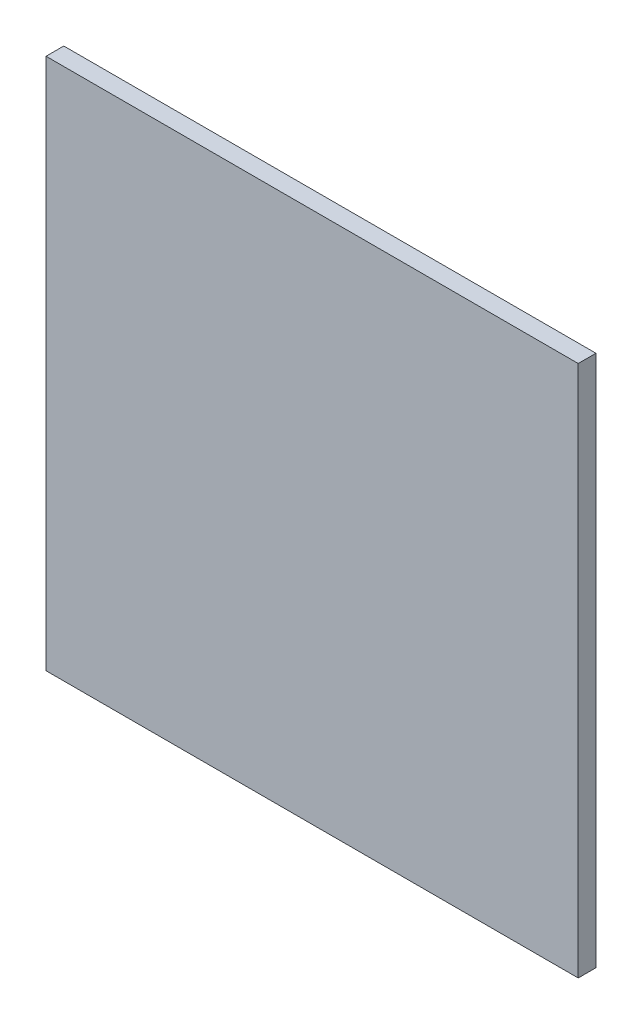
ISO-10303-21;
HEADER;
FILE_DESCRIPTION(('STEP AP214'),'2;1');
FILE_NAME('part.step','',(''),(''),'','','');
FILE_SCHEMA(('AUTOMOTIVE_DESIGN { 1 0 10303 214 1 1 1 1 }'));
ENDSEC;
DATA;
#1=APPLICATION_CONTEXT('core data for automotive mechanical design processes');
#2=APPLICATION_PROTOCOL_DEFINITION('international standard','automotive_design',2000,#1);
#3=PRODUCT_CONTEXT('',#1,'mechanical');
#4=PRODUCT('Part','Part','',(#3));
#5=PRODUCT_RELATED_PRODUCT_CATEGORY('part','',(#4));
#6=PRODUCT_DEFINITION_FORMATION('','',#4);
#7=PRODUCT_DEFINITION_CONTEXT('part definition',#1,'design');
#8=PRODUCT_DEFINITION('design','',#6,#7);
#9=PRODUCT_DEFINITION_SHAPE('','',#8);
#10=(LENGTH_UNIT() NAMED_UNIT(*) SI_UNIT(.MILLI.,.METRE.));
#11=(NAMED_UNIT(*) PLANE_ANGLE_UNIT() SI_UNIT($,.RADIAN.));
#12=(NAMED_UNIT(*) SI_UNIT($,.STERADIAN.) SOLID_ANGLE_UNIT());
#13=UNCERTAINTY_MEASURE_WITH_UNIT(LENGTH_MEASURE(1.E-05),#10,'distance_accuracy_value','');
#14=(GEOMETRIC_REPRESENTATION_CONTEXT(3) GLOBAL_UNCERTAINTY_ASSIGNED_CONTEXT((#13)) GLOBAL_UNIT_ASSIGNED_CONTEXT((#10,
#11,#12)) REPRESENTATION_CONTEXT('',''));
#15=CARTESIAN_POINT('',(0.,0.,0.));
#16=DIRECTION('',(0.,0.,1.));
#17=DIRECTION('',(1.,0.,0.));
#18=AXIS2_PLACEMENT_3D('',#15,#16,#17);
#19=CARTESIAN_POINT('',(0.,0.,10.));
#20=DIRECTION('',(1.,0.,0.));
#21=DIRECTION('',(0.,0.,-1.));
#22=AXIS2_PLACEMENT_3D('',#19,#20,#21);
#23=PLANE('',#22);
#24=DIRECTION('',(0.,-1.,0.));
#25=VECTOR('',#24,1.);
#26=CARTESIAN_POINT('',(0.,0.,0.));
#27=LINE('',#26,#25);
#28=CARTESIAN_POINT('',(0.,300.,0.));
#29=VERTEX_POINT('',#28);
#30=CARTESIAN_POINT('',(0.,0.,0.));
#31=VERTEX_POINT('',#30);
#32=EDGE_CURVE('E96',#29,#31,#27,.T.);
#33=ORIENTED_EDGE('',*,*,#32,.T.);
#34=DIRECTION('',(0.,0.,-1.));
#35=VECTOR('',#34,1.);
#36=CARTESIAN_POINT('',(0.,0.,10.));
#37=LINE('',#36,#35);
#38=CARTESIAN_POINT('',(0.,0.,10.));
#39=VERTEX_POINT('',#38);
#40=EDGE_CURVE('E11',#39,#31,#37,.T.);
#41=ORIENTED_EDGE('',*,*,#40,.F.);
#42=DIRECTION('',(0.,-1.,0.));
#43=VECTOR('',#42,1.);
#44=CARTESIAN_POINT('',(0.,0.,10.));
#45=LINE('',#44,#43);
#46=CARTESIAN_POINT('',(0.,300.,10.));
#47=VERTEX_POINT('',#46);
#48=EDGE_CURVE('E84',#47,#39,#45,.T.);
#49=ORIENTED_EDGE('',*,*,#48,.F.);
#50=DIRECTION('',(0.,0.,-1.));
#51=VECTOR('',#50,1.);
#52=CARTESIAN_POINT('',(0.,300.,10.));
#53=LINE('',#52,#51);
#54=EDGE_CURVE('E92',#47,#29,#53,.T.);
#55=ORIENTED_EDGE('',*,*,#54,.T.);
#56=EDGE_LOOP('',(#33,#41,#49,#55));
#57=FACE_BOUND('',#56,.T.);
#58=ADVANCED_FACE('F33',(#57),#23,.F.);
#59=CARTESIAN_POINT('',(0.,0.,10.));
#60=DIRECTION('',(0.,1.,0.));
#61=DIRECTION('',(0.,0.,1.));
#62=AXIS2_PLACEMENT_3D('',#59,#60,#61);
#63=PLANE('',#62);
#64=DIRECTION('',(1.,0.,0.));
#65=VECTOR('',#64,1.);
#66=CARTESIAN_POINT('',(0.,0.,0.));
#67=LINE('',#66,#65);
#68=CARTESIAN_POINT('',(300.,0.,0.));
#69=VERTEX_POINT('',#68);
#70=EDGE_CURVE('E88',#31,#69,#67,.T.);
#71=ORIENTED_EDGE('',*,*,#70,.T.);
#72=DIRECTION('',(0.,0.,-1.));
#73=VECTOR('',#72,1.);
#74=CARTESIAN_POINT('',(300.,0.,10.));
#75=LINE('',#74,#73);
#76=CARTESIAN_POINT('',(300.,0.,10.));
#77=VERTEX_POINT('',#76);
#78=EDGE_CURVE('E41',#77,#69,#75,.T.);
#79=ORIENTED_EDGE('',*,*,#78,.F.);
#80=DIRECTION('',(1.,0.,0.));
#81=VECTOR('',#80,1.);
#82=CARTESIAN_POINT('',(0.,0.,10.));
#83=LINE('',#82,#81);
#84=EDGE_CURVE('E79',#39,#77,#83,.T.);
#85=ORIENTED_EDGE('',*,*,#84,.F.);
#86=ORIENTED_EDGE('',*,*,#40,.T.);
#87=EDGE_LOOP('',(#71,#79,#85,#86));
#88=FACE_BOUND('',#87,.T.);
#89=ADVANCED_FACE('F87',(#88),#63,.F.);
#90=CARTESIAN_POINT('',(300.,0.,10.));
#91=DIRECTION('',(-1.,0.,0.));
#92=DIRECTION('',(0.,0.,1.));
#93=AXIS2_PLACEMENT_3D('',#90,#91,#92);
#94=PLANE('',#93);
#95=DIRECTION('',(0.,1.,0.));
#96=VECTOR('',#95,1.);
#97=CARTESIAN_POINT('',(300.,0.,0.));
#98=LINE('',#97,#96);
#99=CARTESIAN_POINT('',(300.,300.,0.));
#100=VERTEX_POINT('',#99);
#101=EDGE_CURVE('E66',#69,#100,#98,.T.);
#102=ORIENTED_EDGE('',*,*,#101,.T.);
#103=DIRECTION('',(0.,0.,-1.));
#104=VECTOR('',#103,1.);
#105=CARTESIAN_POINT('',(300.,300.,10.));
#106=LINE('',#105,#104);
#107=CARTESIAN_POINT('',(300.,300.,10.));
#108=VERTEX_POINT('',#107);
#109=EDGE_CURVE('E89',#108,#100,#106,.T.);
#110=ORIENTED_EDGE('',*,*,#109,.F.);
#111=DIRECTION('',(0.,1.,0.));
#112=VECTOR('',#111,1.);
#113=CARTESIAN_POINT('',(300.,0.,10.));
#114=LINE('',#113,#112);
#115=EDGE_CURVE('E82',#77,#108,#114,.T.);
#116=ORIENTED_EDGE('',*,*,#115,.F.);
#117=ORIENTED_EDGE('',*,*,#78,.T.);
#118=EDGE_LOOP('',(#102,#110,#116,#117));
#119=FACE_BOUND('',#118,.T.);
#120=ADVANCED_FACE('F90',(#119),#94,.F.);
#121=CARTESIAN_POINT('',(0.,300.,10.));
#122=DIRECTION('',(0.,-1.,0.));
#123=DIRECTION('',(0.,0.,-1.));
#124=AXIS2_PLACEMENT_3D('',#121,#122,#123);
#125=PLANE('',#124);
#126=DIRECTION('',(-1.,0.,0.));
#127=VECTOR('',#126,1.);
#128=CARTESIAN_POINT('',(0.,300.,0.));
#129=LINE('',#128,#127);
#130=EDGE_CURVE('E72',#100,#29,#129,.T.);
#131=ORIENTED_EDGE('',*,*,#130,.T.);
#132=ORIENTED_EDGE('',*,*,#54,.F.);
#133=DIRECTION('',(-1.,0.,0.));
#134=VECTOR('',#133,1.);
#135=CARTESIAN_POINT('',(0.,300.,10.));
#136=LINE('',#135,#134);
#137=EDGE_CURVE('E49',#108,#47,#136,.T.);
#138=ORIENTED_EDGE('',*,*,#137,.F.);
#139=ORIENTED_EDGE('',*,*,#109,.T.);
#140=EDGE_LOOP('',(#131,#132,#138,#139));
#141=FACE_BOUND('',#140,.T.);
#142=ADVANCED_FACE('F103',(#141),#125,.F.);
#143=CARTESIAN_POINT('',(0.,0.,10.));
#144=DIRECTION('',(0.,0.,-1.));
#145=DIRECTION('',(-1.,0.,0.));
#146=AXIS2_PLACEMENT_3D('',#143,#144,#145);
#147=PLANE('',#146);
#148=ORIENTED_EDGE('',*,*,#48,.T.);
#149=ORIENTED_EDGE('',*,*,#84,.T.);
#150=ORIENTED_EDGE('',*,*,#115,.T.);
#151=ORIENTED_EDGE('',*,*,#137,.T.);
#152=EDGE_LOOP('',(#148,#149,#150,#151));
#153=FACE_BOUND('',#152,.T.);
#154=ADVANCED_FACE('F80',(#153),#147,.F.);
#155=CARTESIAN_POINT('',(0.,0.,0.));
#156=DIRECTION('',(0.,0.,-1.));
#157=DIRECTION('',(-1.,0.,0.));
#158=AXIS2_PLACEMENT_3D('',#155,#156,#157);
#159=PLANE('',#158);
#160=ORIENTED_EDGE('',*,*,#32,.F.);
#161=ORIENTED_EDGE('',*,*,#130,.F.);
#162=ORIENTED_EDGE('',*,*,#101,.F.);
#163=ORIENTED_EDGE('',*,*,#70,.F.);
#164=EDGE_LOOP('',(#160,#161,#162,#163));
#165=FACE_BOUND('',#164,.T.);
#166=ADVANCED_FACE('F106',(#165),#159,.T.);
#167=CLOSED_SHELL('',(#58,#89,#120,#142,#154,#166));
#168=MANIFOLD_SOLID_BREP('B2',#167);
#169=ADVANCED_BREP_SHAPE_REPRESENTATION('',(#18,#168),#14);
#170=SHAPE_DEFINITION_REPRESENTATION(#9,#169);
ENDSEC;
END-ISO-10303-21;
